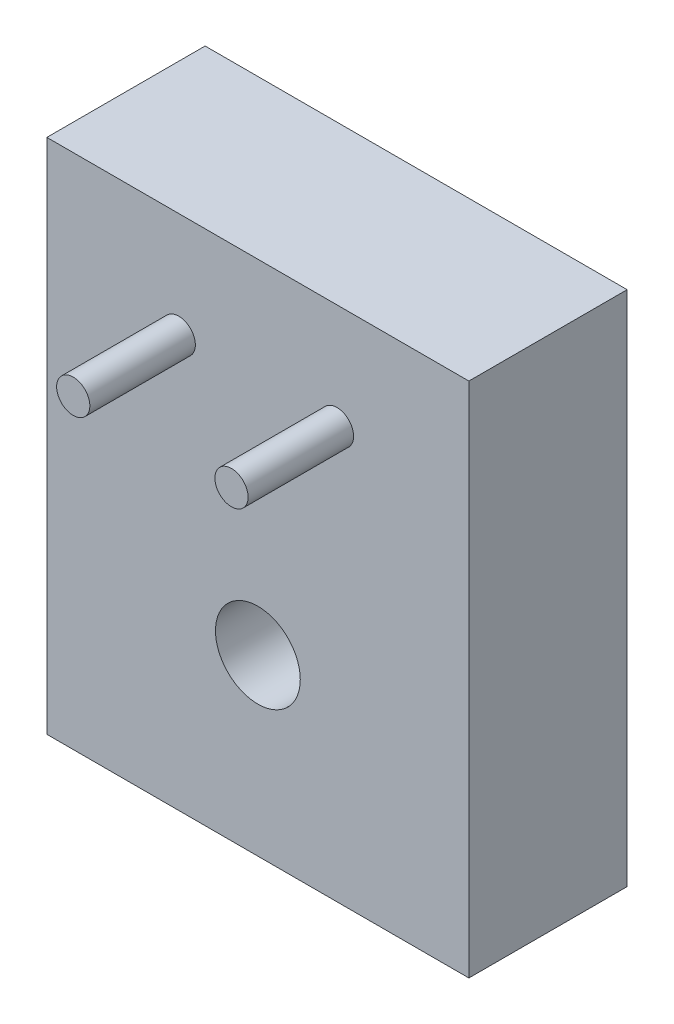
ISO-10303-21;
HEADER;
FILE_DESCRIPTION(('STEP AP214'),'2;1');
FILE_NAME('part.step','',(''),(''),'','','');
FILE_SCHEMA(('AUTOMOTIVE_DESIGN { 1 0 10303 214 1 1 1 1 }'));
ENDSEC;
DATA;
#1=APPLICATION_CONTEXT('core data for automotive mechanical design processes');
#2=APPLICATION_PROTOCOL_DEFINITION('international standard','automotive_design',2000,#1);
#3=PRODUCT_CONTEXT('',#1,'mechanical');
#4=PRODUCT('Part','Part','',(#3));
#5=PRODUCT_RELATED_PRODUCT_CATEGORY('part','',(#4));
#6=PRODUCT_DEFINITION_FORMATION('','',#4);
#7=PRODUCT_DEFINITION_CONTEXT('part definition',#1,'design');
#8=PRODUCT_DEFINITION('design','',#6,#7);
#9=PRODUCT_DEFINITION_SHAPE('','',#8);
#10=(LENGTH_UNIT() NAMED_UNIT(*) SI_UNIT(.MILLI.,.METRE.));
#11=(NAMED_UNIT(*) PLANE_ANGLE_UNIT() SI_UNIT($,.RADIAN.));
#12=(NAMED_UNIT(*) SI_UNIT($,.STERADIAN.) SOLID_ANGLE_UNIT());
#13=UNCERTAINTY_MEASURE_WITH_UNIT(LENGTH_MEASURE(1.E-05),#10,'distance_accuracy_value','');
#14=(GEOMETRIC_REPRESENTATION_CONTEXT(3) GLOBAL_UNCERTAINTY_ASSIGNED_CONTEXT((#13)) GLOBAL_UNIT_ASSIGNED_CONTEXT((#10,
#11,#12)) REPRESENTATION_CONTEXT('',''));
#15=CARTESIAN_POINT('',(0.,0.,0.));
#16=DIRECTION('',(0.,0.,1.));
#17=DIRECTION('',(1.,0.,0.));
#18=AXIS2_PLACEMENT_3D('',#15,#16,#17);
#19=CARTESIAN_POINT('',(0.,0.,9.525));
#20=DIRECTION('',(0.,0.,1.));
#21=DIRECTION('',(1.,0.,0.));
#22=AXIS2_PLACEMENT_3D('',#19,#20,#21);
#23=PLANE('',#22);
#24=CARTESIAN_POINT('',(17.4625,-6.35,9.525));
#25=DIRECTION('',(0.,0.,1.));
#26=DIRECTION('',(1.,0.,0.));
#27=AXIS2_PLACEMENT_3D('',#24,#25,#26);
#28=CIRCLE('',#27,1.);
#29=CARTESIAN_POINT('',(18.4625,-6.35,9.525));
#30=VERTEX_POINT('',#29);
#31=EDGE_CURVE('E121',#30,#30,#28,.T.);
#32=ORIENTED_EDGE('',*,*,#31,.F.);
#33=EDGE_LOOP('',(#32));
#34=FACE_BOUND('',#33,.T.);
#35=CARTESIAN_POINT('',(7.9375,-6.35,9.525));
#36=DIRECTION('',(0.,0.,1.));
#37=DIRECTION('',(1.,0.,0.));
#38=AXIS2_PLACEMENT_3D('',#35,#36,#37);
#39=CIRCLE('',#38,1.);
#40=CARTESIAN_POINT('',(8.9375,-6.35,9.525));
#41=VERTEX_POINT('',#40);
#42=EDGE_CURVE('E118',#41,#41,#39,.T.);
#43=ORIENTED_EDGE('',*,*,#42,.F.);
#44=EDGE_LOOP('',(#43));
#45=FACE_BOUND('',#44,.T.);
#46=DIRECTION('',(0.,-1.,0.));
#47=VECTOR('',#46,1.);
#48=CARTESIAN_POINT('',(0.,0.,9.525));
#49=LINE('',#48,#47);
#50=CARTESIAN_POINT('',(0.,0.,9.525));
#51=VERTEX_POINT('',#50);
#52=CARTESIAN_POINT('',(0.,-31.115,9.525));
#53=VERTEX_POINT('',#52);
#54=EDGE_CURVE('E85',#51,#53,#49,.T.);
#55=ORIENTED_EDGE('',*,*,#54,.T.);
#56=DIRECTION('',(1.,0.,0.));
#57=VECTOR('',#56,1.);
#58=CARTESIAN_POINT('',(0.,-31.115,9.525));
#59=LINE('',#58,#57);
#60=CARTESIAN_POINT('',(25.4,-31.115,9.525));
#61=VERTEX_POINT('',#60);
#62=EDGE_CURVE('E80',#53,#61,#59,.T.);
#63=ORIENTED_EDGE('',*,*,#62,.T.);
#64=DIRECTION('',(0.,1.,0.));
#65=VECTOR('',#64,1.);
#66=CARTESIAN_POINT('',(25.4,0.,9.525));
#67=LINE('',#66,#65);
#68=CARTESIAN_POINT('',(25.4,0.,9.525));
#69=VERTEX_POINT('',#68);
#70=EDGE_CURVE('E83',#61,#69,#67,.T.);
#71=ORIENTED_EDGE('',*,*,#70,.T.);
#72=DIRECTION('',(-1.,0.,0.));
#73=VECTOR('',#72,1.);
#74=CARTESIAN_POINT('',(0.,0.,9.525));
#75=LINE('',#74,#73);
#76=EDGE_CURVE('E50',#69,#51,#75,.T.);
#77=ORIENTED_EDGE('',*,*,#76,.T.);
#78=EDGE_LOOP('',(#55,#63,#71,#77));
#79=FACE_BOUND('',#78,.T.);
#80=CARTESIAN_POINT('',(12.7,-20.6375,9.525));
#81=DIRECTION('',(0.,0.,1.));
#82=DIRECTION('',(1.,0.,0.));
#83=AXIS2_PLACEMENT_3D('',#80,#81,#82);
#84=CIRCLE('',#83,2.5527);
#85=CARTESIAN_POINT('',(15.2527,-20.6375,9.525));
#86=VERTEX_POINT('',#85);
#87=EDGE_CURVE('E100',#86,#86,#84,.T.);
#88=ORIENTED_EDGE('',*,*,#87,.F.);
#89=EDGE_LOOP('',(#88));
#90=FACE_BOUND('',#89,.T.);
#91=ADVANCED_FACE('F33',(#34,#45,#79,#90),#23,.T.);
#92=CARTESIAN_POINT('',(0.,0.,0.));
#93=DIRECTION('',(0.,0.,1.));
#94=DIRECTION('',(1.,0.,0.));
#95=AXIS2_PLACEMENT_3D('',#92,#93,#94);
#96=PLANE('',#95);
#97=DIRECTION('',(0.,-1.,0.));
#98=VECTOR('',#97,1.);
#99=CARTESIAN_POINT('',(0.,0.,0.));
#100=LINE('',#99,#98);
#101=CARTESIAN_POINT('',(0.,0.,0.));
#102=VERTEX_POINT('',#101);
#103=CARTESIAN_POINT('',(0.,-31.115,0.));
#104=VERTEX_POINT('',#103);
#105=EDGE_CURVE('E97',#102,#104,#100,.T.);
#106=ORIENTED_EDGE('',*,*,#105,.F.);
#107=DIRECTION('',(-1.,0.,0.));
#108=VECTOR('',#107,1.);
#109=CARTESIAN_POINT('',(0.,0.,0.));
#110=LINE('',#109,#108);
#111=CARTESIAN_POINT('',(25.4,0.,0.));
#112=VERTEX_POINT('',#111);
#113=EDGE_CURVE('E73',#112,#102,#110,.T.);
#114=ORIENTED_EDGE('',*,*,#113,.F.);
#115=DIRECTION('',(0.,1.,0.));
#116=VECTOR('',#115,1.);
#117=CARTESIAN_POINT('',(25.4,0.,0.));
#118=LINE('',#117,#116);
#119=CARTESIAN_POINT('',(25.4,-31.115,0.));
#120=VERTEX_POINT('',#119);
#121=EDGE_CURVE('E67',#120,#112,#118,.T.);
#122=ORIENTED_EDGE('',*,*,#121,.F.);
#123=DIRECTION('',(1.,0.,0.));
#124=VECTOR('',#123,1.);
#125=CARTESIAN_POINT('',(0.,-31.115,0.));
#126=LINE('',#125,#124);
#127=EDGE_CURVE('E89',#104,#120,#126,.T.);
#128=ORIENTED_EDGE('',*,*,#127,.F.);
#129=EDGE_LOOP('',(#106,#114,#122,#128));
#130=FACE_BOUND('',#129,.T.);
#131=CARTESIAN_POINT('',(12.7,-20.6375,0.));
#132=DIRECTION('',(0.,0.,1.));
#133=DIRECTION('',(1.,0.,0.));
#134=AXIS2_PLACEMENT_3D('',#131,#132,#133);
#135=CIRCLE('',#134,2.5527);
#136=CARTESIAN_POINT('',(15.2527,-20.6375,0.));
#137=VERTEX_POINT('',#136);
#138=EDGE_CURVE('E112',#137,#137,#135,.T.);
#139=ORIENTED_EDGE('',*,*,#138,.T.);
#140=EDGE_LOOP('',(#139));
#141=FACE_BOUND('',#140,.T.);
#142=ADVANCED_FACE('F108',(#130,#141),#96,.F.);
#143=CARTESIAN_POINT('',(0.,0.,9.525));
#144=DIRECTION('',(1.,0.,0.));
#145=DIRECTION('',(0.,1.,0.));
#146=AXIS2_PLACEMENT_3D('',#143,#144,#145);
#147=PLANE('',#146);
#148=ORIENTED_EDGE('',*,*,#105,.T.);
#149=DIRECTION('',(0.,0.,-1.));
#150=VECTOR('',#149,1.);
#151=CARTESIAN_POINT('',(0.,-31.115,9.525));
#152=LINE('',#151,#150);
#153=EDGE_CURVE('E11',#53,#104,#152,.T.);
#154=ORIENTED_EDGE('',*,*,#153,.F.);
#155=ORIENTED_EDGE('',*,*,#54,.F.);
#156=DIRECTION('',(0.,0.,-1.));
#157=VECTOR('',#156,1.);
#158=CARTESIAN_POINT('',(0.,0.,9.525));
#159=LINE('',#158,#157);
#160=EDGE_CURVE('E93',#51,#102,#159,.T.);
#161=ORIENTED_EDGE('',*,*,#160,.T.);
#162=EDGE_LOOP('',(#148,#154,#155,#161));
#163=FACE_BOUND('',#162,.T.);
#164=ADVANCED_FACE('F35',(#163),#147,.F.);
#165=CARTESIAN_POINT('',(0.,-31.115,9.525));
#166=DIRECTION('',(0.,1.,0.));
#167=DIRECTION('',(0.,0.,1.));
#168=AXIS2_PLACEMENT_3D('',#165,#166,#167);
#169=PLANE('',#168);
#170=ORIENTED_EDGE('',*,*,#127,.T.);
#171=DIRECTION('',(0.,0.,-1.));
#172=VECTOR('',#171,1.);
#173=CARTESIAN_POINT('',(25.4,-31.115,9.525));
#174=LINE('',#173,#172);
#175=EDGE_CURVE('E42',#61,#120,#174,.T.);
#176=ORIENTED_EDGE('',*,*,#175,.F.);
#177=ORIENTED_EDGE('',*,*,#62,.F.);
#178=ORIENTED_EDGE('',*,*,#153,.T.);
#179=EDGE_LOOP('',(#170,#176,#177,#178));
#180=FACE_BOUND('',#179,.T.);
#181=ADVANCED_FACE('F88',(#180),#169,.F.);
#182=CARTESIAN_POINT('',(25.4,0.,9.525));
#183=DIRECTION('',(-1.,0.,0.));
#184=DIRECTION('',(0.,-1.,0.));
#185=AXIS2_PLACEMENT_3D('',#182,#183,#184);
#186=PLANE('',#185);
#187=ORIENTED_EDGE('',*,*,#121,.T.);
#188=DIRECTION('',(0.,0.,-1.));
#189=VECTOR('',#188,1.);
#190=CARTESIAN_POINT('',(25.4,0.,9.525));
#191=LINE('',#190,#189);
#192=EDGE_CURVE('E90',#69,#112,#191,.T.);
#193=ORIENTED_EDGE('',*,*,#192,.F.);
#194=ORIENTED_EDGE('',*,*,#70,.F.);
#195=ORIENTED_EDGE('',*,*,#175,.T.);
#196=EDGE_LOOP('',(#187,#193,#194,#195));
#197=FACE_BOUND('',#196,.T.);
#198=ADVANCED_FACE('F91',(#197),#186,.F.);
#199=CARTESIAN_POINT('',(0.,0.,9.525));
#200=DIRECTION('',(0.,-1.,0.));
#201=DIRECTION('',(0.,0.,-1.));
#202=AXIS2_PLACEMENT_3D('',#199,#200,#201);
#203=PLANE('',#202);
#204=ORIENTED_EDGE('',*,*,#113,.T.);
#205=ORIENTED_EDGE('',*,*,#160,.F.);
#206=ORIENTED_EDGE('',*,*,#76,.F.);
#207=ORIENTED_EDGE('',*,*,#192,.T.);
#208=EDGE_LOOP('',(#204,#205,#206,#207));
#209=FACE_BOUND('',#208,.T.);
#210=ADVANCED_FACE('F105',(#209),#203,.F.);
#211=CARTESIAN_POINT('',(12.7,-20.6375,9.525));
#212=DIRECTION('',(0.,0.,-1.));
#213=DIRECTION('',(-1.,0.,0.));
#214=AXIS2_PLACEMENT_3D('',#211,#212,#213);
#215=CYLINDRICAL_SURFACE('',#214,2.5527);
#216=ORIENTED_EDGE('',*,*,#87,.T.);
#217=EDGE_LOOP('',(#216));
#218=FACE_BOUND('',#217,.T.);
#219=ORIENTED_EDGE('',*,*,#138,.F.);
#220=EDGE_LOOP('',(#219));
#221=FACE_BOUND('',#220,.T.);
#222=ADVANCED_FACE('F140',(#218,#221),#215,.F.);
#223=CARTESIAN_POINT('',(7.9375,-6.35,15.875));
#224=DIRECTION('',(0.,0.,-1.));
#225=DIRECTION('',(-1.,0.,0.));
#226=AXIS2_PLACEMENT_3D('',#223,#224,#225);
#227=CYLINDRICAL_SURFACE('',#226,1.);
#228=CARTESIAN_POINT('',(7.9375,-6.35,15.875));
#229=DIRECTION('',(0.,0.,1.));
#230=DIRECTION('',(1.,0.,0.));
#231=AXIS2_PLACEMENT_3D('',#228,#229,#230);
#232=CIRCLE('',#231,1.);
#233=CARTESIAN_POINT('',(8.9375,-6.35,15.875));
#234=VERTEX_POINT('',#233);
#235=EDGE_CURVE('E115',#234,#234,#232,.T.);
#236=ORIENTED_EDGE('',*,*,#235,.F.);
#237=EDGE_LOOP('',(#236));
#238=FACE_BOUND('',#237,.T.);
#239=ORIENTED_EDGE('',*,*,#42,.T.);
#240=EDGE_LOOP('',(#239));
#241=FACE_BOUND('',#240,.T.);
#242=ADVANCED_FACE('F137',(#238,#241),#227,.T.);
#243=CARTESIAN_POINT('',(7.9375,-6.35,15.875));
#244=DIRECTION('',(0.,0.,1.));
#245=DIRECTION('',(1.,0.,0.));
#246=AXIS2_PLACEMENT_3D('',#243,#244,#245);
#247=PLANE('',#246);
#248=ORIENTED_EDGE('',*,*,#235,.T.);
#249=EDGE_LOOP('',(#248));
#250=FACE_BOUND('',#249,.T.);
#251=ADVANCED_FACE('F139',(#250),#247,.T.);
#252=CARTESIAN_POINT('',(17.4625,-6.35,15.875));
#253=DIRECTION('',(0.,0.,-1.));
#254=DIRECTION('',(-1.,0.,0.));
#255=AXIS2_PLACEMENT_3D('',#252,#253,#254);
#256=CYLINDRICAL_SURFACE('',#255,1.);
#257=CARTESIAN_POINT('',(17.4625,-6.35,15.875));
#258=DIRECTION('',(0.,0.,1.));
#259=DIRECTION('',(1.,0.,0.));
#260=AXIS2_PLACEMENT_3D('',#257,#258,#259);
#261=CIRCLE('',#260,1.);
#262=CARTESIAN_POINT('',(18.4625,-6.35,15.875));
#263=VERTEX_POINT('',#262);
#264=EDGE_CURVE('E124',#263,#263,#261,.T.);
#265=ORIENTED_EDGE('',*,*,#264,.F.);
#266=EDGE_LOOP('',(#265));
#267=FACE_BOUND('',#266,.T.);
#268=ORIENTED_EDGE('',*,*,#31,.T.);
#269=EDGE_LOOP('',(#268));
#270=FACE_BOUND('',#269,.T.);
#271=ADVANCED_FACE('F130',(#267,#270),#256,.T.);
#272=CARTESIAN_POINT('',(17.4625,-6.35,15.875));
#273=DIRECTION('',(0.,0.,1.));
#274=DIRECTION('',(1.,0.,0.));
#275=AXIS2_PLACEMENT_3D('',#272,#273,#274);
#276=PLANE('',#275);
#277=ORIENTED_EDGE('',*,*,#264,.T.);
#278=EDGE_LOOP('',(#277));
#279=FACE_BOUND('',#278,.T.);
#280=ADVANCED_FACE('F196',(#279),#276,.T.);
#281=CLOSED_SHELL('',(#91,#142,#164,#181,#198,#210,#222,#242,#251,#271,#280));
#282=MANIFOLD_SOLID_BREP('B2',#281);
#283=ADVANCED_BREP_SHAPE_REPRESENTATION('',(#18,#282),#14);
#284=SHAPE_DEFINITION_REPRESENTATION(#9,#283);
ENDSEC;
END-ISO-10303-21;
